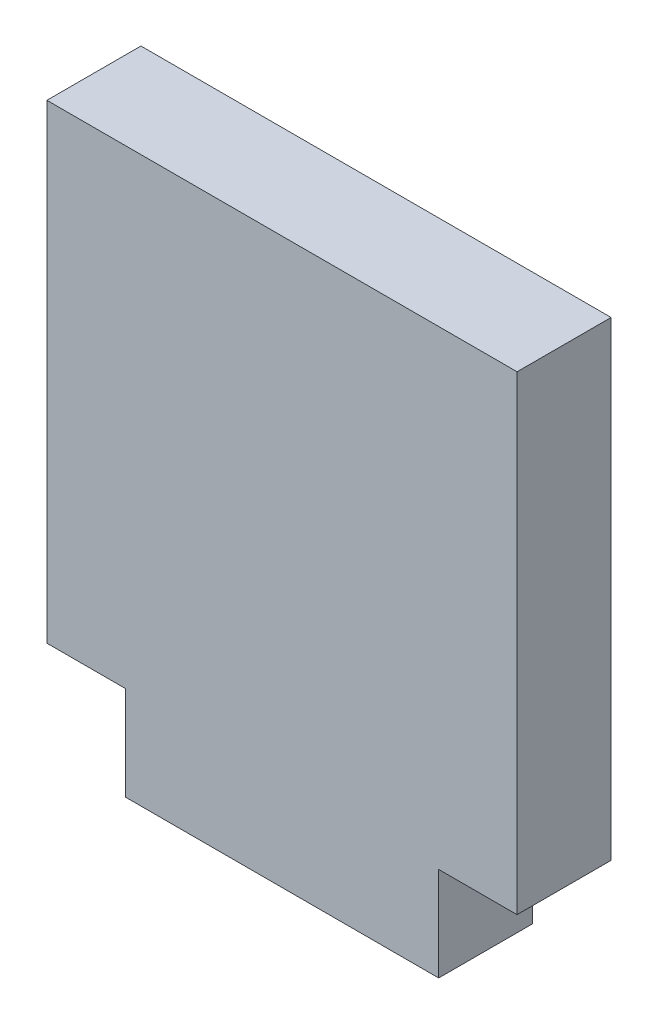
ISO-10303-21;
HEADER;
FILE_DESCRIPTION(('STEP AP214'),'2;1');
FILE_NAME('part.step','',(''),(''),'','','');
FILE_SCHEMA(('AUTOMOTIVE_DESIGN { 1 0 10303 214 1 1 1 1 }'));
ENDSEC;
DATA;
#1=APPLICATION_CONTEXT('core data for automotive mechanical design processes');
#2=APPLICATION_PROTOCOL_DEFINITION('international standard','automotive_design',2000,#1);
#3=PRODUCT_CONTEXT('',#1,'mechanical');
#4=PRODUCT('Part','Part','',(#3));
#5=PRODUCT_RELATED_PRODUCT_CATEGORY('part','',(#4));
#6=PRODUCT_DEFINITION_FORMATION('','',#4);
#7=PRODUCT_DEFINITION_CONTEXT('part definition',#1,'design');
#8=PRODUCT_DEFINITION('design','',#6,#7);
#9=PRODUCT_DEFINITION_SHAPE('','',#8);
#10=(LENGTH_UNIT() NAMED_UNIT(*) SI_UNIT(.MILLI.,.METRE.));
#11=(NAMED_UNIT(*) PLANE_ANGLE_UNIT() SI_UNIT($,.RADIAN.));
#12=(NAMED_UNIT(*) SI_UNIT($,.STERADIAN.) SOLID_ANGLE_UNIT());
#13=UNCERTAINTY_MEASURE_WITH_UNIT(LENGTH_MEASURE(1.E-05),#10,'distance_accuracy_value','');
#14=(GEOMETRIC_REPRESENTATION_CONTEXT(3) GLOBAL_UNCERTAINTY_ASSIGNED_CONTEXT((#13)) GLOBAL_UNIT_ASSIGNED_CONTEXT((#10,
#11,#12)) REPRESENTATION_CONTEXT('',''));
#15=CARTESIAN_POINT('',(0.,0.,0.));
#16=DIRECTION('',(0.,0.,1.));
#17=DIRECTION('',(1.,0.,0.));
#18=AXIS2_PLACEMENT_3D('',#15,#16,#17);
#19=CARTESIAN_POINT('',(7.5,0.,3.));
#20=DIRECTION('',(1.,0.,0.));
#21=DIRECTION('',(0.,1.,0.));
#22=AXIS2_PLACEMENT_3D('',#19,#20,#21);
#23=PLANE('',#22);
#24=DIRECTION('',(0.,-1.,0.));
#25=VECTOR('',#24,1.);
#26=CARTESIAN_POINT('',(7.5,0.,0.));
#27=LINE('',#26,#25);
#28=CARTESIAN_POINT('',(7.5,15.,0.));
#29=VERTEX_POINT('',#28);
#30=CARTESIAN_POINT('',(7.5,0.,0.));
#31=VERTEX_POINT('',#30);
#32=EDGE_CURVE('E140',#29,#31,#27,.T.);
#33=ORIENTED_EDGE('',*,*,#32,.F.);
#34=DIRECTION('',(0.,0.,-1.));
#35=VECTOR('',#34,1.);
#36=CARTESIAN_POINT('',(7.5,15.,3.));
#37=LINE('',#36,#35);
#38=CARTESIAN_POINT('',(7.5,15.,3.));
#39=VERTEX_POINT('',#38);
#40=EDGE_CURVE('E11',#39,#29,#37,.T.);
#41=ORIENTED_EDGE('',*,*,#40,.F.);
#42=DIRECTION('',(0.,-1.,0.));
#43=VECTOR('',#42,1.);
#44=CARTESIAN_POINT('',(7.5,0.,3.));
#45=LINE('',#44,#43);
#46=CARTESIAN_POINT('',(7.5,0.,3.));
#47=VERTEX_POINT('',#46);
#48=EDGE_CURVE('E194',#39,#47,#45,.T.);
#49=ORIENTED_EDGE('',*,*,#48,.T.);
#50=DIRECTION('',(0.,0.,-1.));
#51=VECTOR('',#50,1.);
#52=CARTESIAN_POINT('',(7.5,0.,3.));
#53=LINE('',#52,#51);
#54=EDGE_CURVE('E92',#47,#31,#53,.T.);
#55=ORIENTED_EDGE('',*,*,#54,.T.);
#56=EDGE_LOOP('',(#33,#41,#49,#55));
#57=FACE_BOUND('',#56,.T.);
#58=ADVANCED_FACE('F41',(#57),#23,.T.);
#59=CARTESIAN_POINT('',(0.,15.,3.));
#60=DIRECTION('',(0.,1.,0.));
#61=DIRECTION('',(0.,0.,1.));
#62=AXIS2_PLACEMENT_3D('',#59,#60,#61);
#63=PLANE('',#62);
#64=DIRECTION('',(1.,0.,0.));
#65=VECTOR('',#64,1.);
#66=CARTESIAN_POINT('',(0.,15.,0.));
#67=LINE('',#66,#65);
#68=CARTESIAN_POINT('',(-7.5,15.,0.));
#69=VERTEX_POINT('',#68);
#70=EDGE_CURVE('E144',#69,#29,#67,.T.);
#71=ORIENTED_EDGE('',*,*,#70,.F.);
#72=DIRECTION('',(0.,0.,-1.));
#73=VECTOR('',#72,1.);
#74=CARTESIAN_POINT('',(-7.5,15.,3.));
#75=LINE('',#74,#73);
#76=CARTESIAN_POINT('',(-7.5,15.,3.));
#77=VERTEX_POINT('',#76);
#78=EDGE_CURVE('E50',#77,#69,#75,.T.);
#79=ORIENTED_EDGE('',*,*,#78,.F.);
#80=DIRECTION('',(1.,0.,0.));
#81=VECTOR('',#80,1.);
#82=CARTESIAN_POINT('',(0.,15.,3.));
#83=LINE('',#82,#81);
#84=EDGE_CURVE('E192',#77,#39,#83,.T.);
#85=ORIENTED_EDGE('',*,*,#84,.T.);
#86=ORIENTED_EDGE('',*,*,#40,.T.);
#87=EDGE_LOOP('',(#71,#79,#85,#86));
#88=FACE_BOUND('',#87,.T.);
#89=ADVANCED_FACE('F191',(#88),#63,.T.);
#90=CARTESIAN_POINT('',(-7.5,0.,3.));
#91=DIRECTION('',(1.,0.,0.));
#92=DIRECTION('',(0.,1.,0.));
#93=AXIS2_PLACEMENT_3D('',#90,#91,#92);
#94=PLANE('',#93);
#95=DIRECTION('',(0.,-1.,0.));
#96=VECTOR('',#95,1.);
#97=CARTESIAN_POINT('',(-7.5,0.,0.));
#98=LINE('',#97,#96);
#99=CARTESIAN_POINT('',(-7.5,0.,0.));
#100=VERTEX_POINT('',#99);
#101=EDGE_CURVE('E148',#69,#100,#98,.T.);
#102=ORIENTED_EDGE('',*,*,#101,.T.);
#103=DIRECTION('',(0.,0.,-1.));
#104=VECTOR('',#103,1.);
#105=CARTESIAN_POINT('',(-7.5,0.,3.));
#106=LINE('',#105,#104);
#107=CARTESIAN_POINT('',(-7.5,0.,3.));
#108=VERTEX_POINT('',#107);
#109=EDGE_CURVE('E173',#108,#100,#106,.T.);
#110=ORIENTED_EDGE('',*,*,#109,.F.);
#111=DIRECTION('',(0.,-1.,0.));
#112=VECTOR('',#111,1.);
#113=CARTESIAN_POINT('',(-7.5,0.,3.));
#114=LINE('',#113,#112);
#115=EDGE_CURVE('E182',#77,#108,#114,.T.);
#116=ORIENTED_EDGE('',*,*,#115,.F.);
#117=ORIENTED_EDGE('',*,*,#78,.T.);
#118=EDGE_LOOP('',(#102,#110,#116,#117));
#119=FACE_BOUND('',#118,.T.);
#120=ADVANCED_FACE('F180',(#119),#94,.F.);
#121=CARTESIAN_POINT('',(0.,0.,3.));
#122=DIRECTION('',(0.,1.,0.));
#123=DIRECTION('',(0.,0.,1.));
#124=AXIS2_PLACEMENT_3D('',#121,#122,#123);
#125=PLANE('',#124);
#126=DIRECTION('',(1.,0.,0.));
#127=VECTOR('',#126,1.);
#128=CARTESIAN_POINT('',(0.,0.,0.));
#129=LINE('',#128,#127);
#130=CARTESIAN_POINT('',(-5.,0.,0.));
#131=VERTEX_POINT('',#130);
#132=EDGE_CURVE('E151',#100,#131,#129,.T.);
#133=ORIENTED_EDGE('',*,*,#132,.T.);
#134=DIRECTION('',(0.,0.,-1.));
#135=VECTOR('',#134,1.);
#136=CARTESIAN_POINT('',(-5.,0.,3.));
#137=LINE('',#136,#135);
#138=CARTESIAN_POINT('',(-5.,0.,3.));
#139=VERTEX_POINT('',#138);
#140=EDGE_CURVE('E169',#139,#131,#137,.T.);
#141=ORIENTED_EDGE('',*,*,#140,.F.);
#142=DIRECTION('',(1.,0.,0.));
#143=VECTOR('',#142,1.);
#144=CARTESIAN_POINT('',(0.,0.,3.));
#145=LINE('',#144,#143);
#146=EDGE_CURVE('E137',#108,#139,#145,.T.);
#147=ORIENTED_EDGE('',*,*,#146,.F.);
#148=ORIENTED_EDGE('',*,*,#109,.T.);
#149=EDGE_LOOP('',(#133,#141,#147,#148));
#150=FACE_BOUND('',#149,.T.);
#151=ADVANCED_FACE('F206',(#150),#125,.F.);
#152=CARTESIAN_POINT('',(-5.,0.,3.));
#153=DIRECTION('',(1.,0.,0.));
#154=DIRECTION('',(0.,1.,0.));
#155=AXIS2_PLACEMENT_3D('',#152,#153,#154);
#156=PLANE('',#155);
#157=DIRECTION('',(0.,-1.,0.));
#158=VECTOR('',#157,1.);
#159=CARTESIAN_POINT('',(-5.,0.,0.));
#160=LINE('',#159,#158);
#161=CARTESIAN_POINT('',(-5.,-3.,0.));
#162=VERTEX_POINT('',#161);
#163=EDGE_CURVE('E154',#131,#162,#160,.T.);
#164=ORIENTED_EDGE('',*,*,#163,.T.);
#165=DIRECTION('',(0.,0.,-1.));
#166=VECTOR('',#165,1.);
#167=CARTESIAN_POINT('',(-5.,-3.,3.));
#168=LINE('',#167,#166);
#169=CARTESIAN_POINT('',(-5.,-3.,3.));
#170=VERTEX_POINT('',#169);
#171=EDGE_CURVE('E130',#170,#162,#168,.T.);
#172=ORIENTED_EDGE('',*,*,#171,.F.);
#173=DIRECTION('',(0.,-1.,0.));
#174=VECTOR('',#173,1.);
#175=CARTESIAN_POINT('',(-5.,0.,3.));
#176=LINE('',#175,#174);
#177=EDGE_CURVE('E115',#139,#170,#176,.T.);
#178=ORIENTED_EDGE('',*,*,#177,.F.);
#179=ORIENTED_EDGE('',*,*,#140,.T.);
#180=EDGE_LOOP('',(#164,#172,#178,#179));
#181=FACE_BOUND('',#180,.T.);
#182=ADVANCED_FACE('F208',(#181),#156,.F.);
#183=CARTESIAN_POINT('',(0.,-3.,3.));
#184=DIRECTION('',(0.,1.,0.));
#185=DIRECTION('',(-1.,0.,0.));
#186=AXIS2_PLACEMENT_3D('',#183,#184,#185);
#187=PLANE('',#186);
#188=DIRECTION('',(1.,0.,0.));
#189=VECTOR('',#188,1.);
#190=CARTESIAN_POINT('',(0.,-3.,0.));
#191=LINE('',#190,#189);
#192=CARTESIAN_POINT('',(5.,-3.,0.));
#193=VERTEX_POINT('',#192);
#194=EDGE_CURVE('E125',#162,#193,#191,.T.);
#195=ORIENTED_EDGE('',*,*,#194,.T.);
#196=DIRECTION('',(0.,0.,-1.));
#197=VECTOR('',#196,1.);
#198=CARTESIAN_POINT('',(5.,-3.,3.));
#199=LINE('',#198,#197);
#200=CARTESIAN_POINT('',(5.,-3.,3.));
#201=VERTEX_POINT('',#200);
#202=EDGE_CURVE('E122',#201,#193,#199,.T.);
#203=ORIENTED_EDGE('',*,*,#202,.F.);
#204=DIRECTION('',(1.,0.,0.));
#205=VECTOR('',#204,1.);
#206=CARTESIAN_POINT('',(0.,-3.,3.));
#207=LINE('',#206,#205);
#208=EDGE_CURVE('E109',#170,#201,#207,.T.);
#209=ORIENTED_EDGE('',*,*,#208,.F.);
#210=ORIENTED_EDGE('',*,*,#171,.T.);
#211=EDGE_LOOP('',(#195,#203,#209,#210));
#212=FACE_BOUND('',#211,.T.);
#213=ADVANCED_FACE('F123',(#212),#187,.F.);
#214=CARTESIAN_POINT('',(5.,0.,3.));
#215=DIRECTION('',(1.,0.,0.));
#216=DIRECTION('',(0.,1.,0.));
#217=AXIS2_PLACEMENT_3D('',#214,#215,#216);
#218=PLANE('',#217);
#219=DIRECTION('',(0.,-1.,0.));
#220=VECTOR('',#219,1.);
#221=CARTESIAN_POINT('',(5.,0.,0.));
#222=LINE('',#221,#220);
#223=CARTESIAN_POINT('',(5.,0.,0.));
#224=VERTEX_POINT('',#223);
#225=EDGE_CURVE('E160',#224,#193,#222,.T.);
#226=ORIENTED_EDGE('',*,*,#225,.F.);
#227=DIRECTION('',(0.,0.,-1.));
#228=VECTOR('',#227,1.);
#229=CARTESIAN_POINT('',(5.,0.,3.));
#230=LINE('',#229,#228);
#231=CARTESIAN_POINT('',(5.,0.,3.));
#232=VERTEX_POINT('',#231);
#233=EDGE_CURVE('E85',#232,#224,#230,.T.);
#234=ORIENTED_EDGE('',*,*,#233,.F.);
#235=DIRECTION('',(0.,-1.,0.));
#236=VECTOR('',#235,1.);
#237=CARTESIAN_POINT('',(5.,0.,3.));
#238=LINE('',#237,#236);
#239=EDGE_CURVE('E113',#232,#201,#238,.T.);
#240=ORIENTED_EDGE('',*,*,#239,.T.);
#241=ORIENTED_EDGE('',*,*,#202,.T.);
#242=EDGE_LOOP('',(#226,#234,#240,#241));
#243=FACE_BOUND('',#242,.T.);
#244=ADVANCED_FACE('F132',(#243),#218,.T.);
#245=EDGE_CURVE('E155',#224,#31,#129,.T.);
#246=ORIENTED_EDGE('',*,*,#245,.T.);
#247=ORIENTED_EDGE('',*,*,#54,.F.);
#248=EDGE_CURVE('E58',#232,#47,#145,.T.);
#249=ORIENTED_EDGE('',*,*,#248,.F.);
#250=ORIENTED_EDGE('',*,*,#233,.T.);
#251=EDGE_LOOP('',(#246,#247,#249,#250));
#252=FACE_BOUND('',#251,.T.);
#253=ADVANCED_FACE('F217',(#252),#125,.F.);
#254=CARTESIAN_POINT('',(0.,0.,3.));
#255=DIRECTION('',(0.,0.,1.));
#256=DIRECTION('',(1.,0.,0.));
#257=AXIS2_PLACEMENT_3D('',#254,#255,#256);
#258=PLANE('',#257);
#259=ORIENTED_EDGE('',*,*,#48,.F.);
#260=ORIENTED_EDGE('',*,*,#84,.F.);
#261=ORIENTED_EDGE('',*,*,#115,.T.);
#262=ORIENTED_EDGE('',*,*,#146,.T.);
#263=ORIENTED_EDGE('',*,*,#177,.T.);
#264=ORIENTED_EDGE('',*,*,#208,.T.);
#265=ORIENTED_EDGE('',*,*,#239,.F.);
#266=ORIENTED_EDGE('',*,*,#248,.T.);
#267=EDGE_LOOP('',(#259,#260,#261,#262,#263,#264,#265,#266));
#268=FACE_BOUND('',#267,.T.);
#269=ADVANCED_FACE('F111',(#268),#258,.T.);
#270=CARTESIAN_POINT('',(0.,0.,0.));
#271=DIRECTION('',(0.,0.,1.));
#272=DIRECTION('',(1.,0.,0.));
#273=AXIS2_PLACEMENT_3D('',#270,#271,#272);
#274=PLANE('',#273);
#275=ORIENTED_EDGE('',*,*,#32,.T.);
#276=ORIENTED_EDGE('',*,*,#245,.F.);
#277=ORIENTED_EDGE('',*,*,#225,.T.);
#278=ORIENTED_EDGE('',*,*,#194,.F.);
#279=ORIENTED_EDGE('',*,*,#163,.F.);
#280=ORIENTED_EDGE('',*,*,#132,.F.);
#281=ORIENTED_EDGE('',*,*,#101,.F.);
#282=ORIENTED_EDGE('',*,*,#70,.T.);
#283=EDGE_LOOP('',(#275,#276,#277,#278,#279,#280,#281,#282));
#284=FACE_BOUND('',#283,.T.);
#285=ADVANCED_FACE('F189',(#284),#274,.F.);
#286=CLOSED_SHELL('',(#58,#89,#120,#151,#182,#213,#244,#253,#269,#285));
#287=MANIFOLD_SOLID_BREP('B2',#286);
#288=ADVANCED_BREP_SHAPE_REPRESENTATION('',(#18,#287),#14);
#289=SHAPE_DEFINITION_REPRESENTATION(#9,#288);
ENDSEC;
END-ISO-10303-21;
